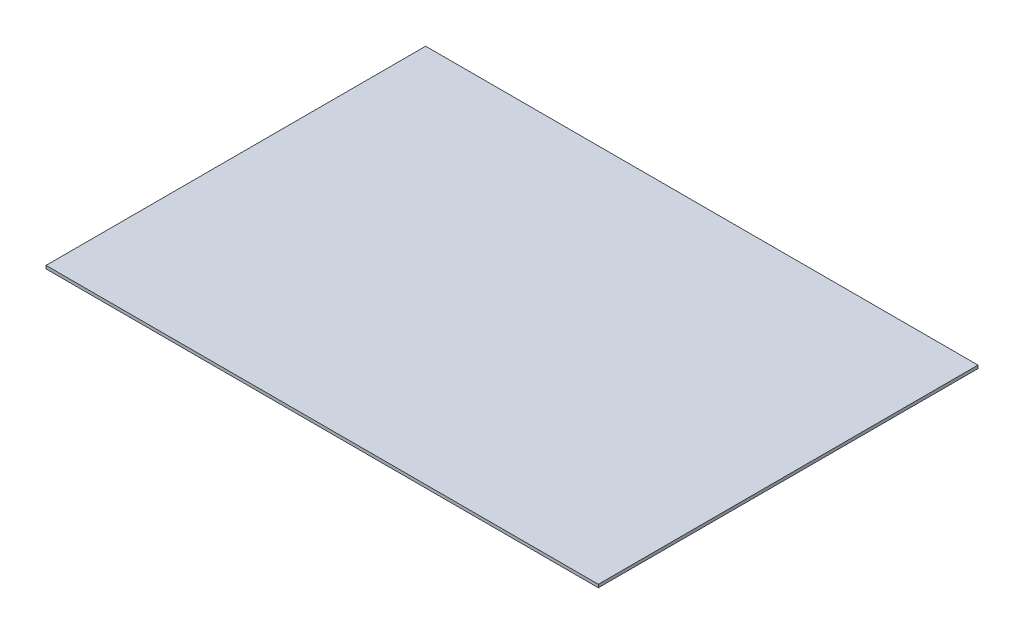
ISO-10303-21;
HEADER;
FILE_DESCRIPTION(('STEP AP214'),'2;1');
FILE_NAME('part.step','',(''),(''),'','','');
FILE_SCHEMA(('AUTOMOTIVE_DESIGN { 1 0 10303 214 1 1 1 1 }'));
ENDSEC;
DATA;
#1=APPLICATION_CONTEXT('core data for automotive mechanical design processes');
#2=APPLICATION_PROTOCOL_DEFINITION('international standard','automotive_design',2000,#1);
#3=PRODUCT_CONTEXT('',#1,'mechanical');
#4=PRODUCT('Part','Part','',(#3));
#5=PRODUCT_RELATED_PRODUCT_CATEGORY('part','',(#4));
#6=PRODUCT_DEFINITION_FORMATION('','',#4);
#7=PRODUCT_DEFINITION_CONTEXT('part definition',#1,'design');
#8=PRODUCT_DEFINITION('design','',#6,#7);
#9=PRODUCT_DEFINITION_SHAPE('','',#8);
#10=(LENGTH_UNIT() NAMED_UNIT(*) SI_UNIT(.MILLI.,.METRE.));
#11=(NAMED_UNIT(*) PLANE_ANGLE_UNIT() SI_UNIT($,.RADIAN.));
#12=(NAMED_UNIT(*) SI_UNIT($,.STERADIAN.) SOLID_ANGLE_UNIT());
#13=UNCERTAINTY_MEASURE_WITH_UNIT(LENGTH_MEASURE(1.E-05),#10,'distance_accuracy_value','');
#14=(GEOMETRIC_REPRESENTATION_CONTEXT(3) GLOBAL_UNCERTAINTY_ASSIGNED_CONTEXT((#13)) GLOBAL_UNIT_ASSIGNED_CONTEXT((#10,
#11,#12)) REPRESENTATION_CONTEXT('',''));
#15=CARTESIAN_POINT('',(0.,0.,0.));
#16=DIRECTION('',(0.,0.,1.));
#17=DIRECTION('',(1.,0.,0.));
#18=AXIS2_PLACEMENT_3D('',#15,#16,#17);
#19=CARTESIAN_POINT('',(0.,2.,0.));
#20=DIRECTION('',(0.,0.,-1.));
#21=DIRECTION('',(-1.,0.,0.));
#22=AXIS2_PLACEMENT_3D('',#19,#20,#21);
#23=PLANE('',#22);
#24=DIRECTION('',(1.,0.,0.));
#25=VECTOR('',#24,1.);
#26=CARTESIAN_POINT('',(0.,0.,0.));
#27=LINE('',#26,#25);
#28=CARTESIAN_POINT('',(0.,0.,0.));
#29=VERTEX_POINT('',#28);
#30=CARTESIAN_POINT('',(362.14,0.,0.));
#31=VERTEX_POINT('',#30);
#32=EDGE_CURVE('E101',#29,#31,#27,.T.);
#33=ORIENTED_EDGE('',*,*,#32,.T.);
#34=DIRECTION('',(0.,-1.,0.));
#35=VECTOR('',#34,1.);
#36=CARTESIAN_POINT('',(362.14,2.,0.));
#37=LINE('',#36,#35);
#38=CARTESIAN_POINT('',(362.14,2.,0.));
#39=VERTEX_POINT('',#38);
#40=EDGE_CURVE('E11',#39,#31,#37,.T.);
#41=ORIENTED_EDGE('',*,*,#40,.F.);
#42=DIRECTION('',(1.,0.,0.));
#43=VECTOR('',#42,1.);
#44=CARTESIAN_POINT('',(0.,2.,0.));
#45=LINE('',#44,#43);
#46=CARTESIAN_POINT('',(0.,2.,0.));
#47=VERTEX_POINT('',#46);
#48=EDGE_CURVE('E87',#47,#39,#45,.T.);
#49=ORIENTED_EDGE('',*,*,#48,.F.);
#50=DIRECTION('',(0.,-1.,0.));
#51=VECTOR('',#50,1.);
#52=CARTESIAN_POINT('',(0.,2.,0.));
#53=LINE('',#52,#51);
#54=EDGE_CURVE('E54',#47,#29,#53,.T.);
#55=ORIENTED_EDGE('',*,*,#54,.T.);
#56=EDGE_LOOP('',(#33,#41,#49,#55));
#57=FACE_BOUND('',#56,.T.);
#58=ADVANCED_FACE('F38',(#57),#23,.F.);
#59=CARTESIAN_POINT('',(362.14,2.,0.));
#60=DIRECTION('',(-1.,0.,0.));
#61=DIRECTION('',(0.,0.,1.));
#62=AXIS2_PLACEMENT_3D('',#59,#60,#61);
#63=PLANE('',#62);
#64=DIRECTION('',(0.,0.,-1.));
#65=VECTOR('',#64,1.);
#66=CARTESIAN_POINT('',(362.14,0.,0.));
#67=LINE('',#66,#65);
#68=CARTESIAN_POINT('',(362.14,0.,-248.92));
#69=VERTEX_POINT('',#68);
#70=EDGE_CURVE('E92',#31,#69,#67,.T.);
#71=ORIENTED_EDGE('',*,*,#70,.T.);
#72=DIRECTION('',(0.,-1.,0.));
#73=VECTOR('',#72,1.);
#74=CARTESIAN_POINT('',(362.14,2.,-248.92));
#75=LINE('',#74,#73);
#76=CARTESIAN_POINT('',(362.14,2.,-248.92));
#77=VERTEX_POINT('',#76);
#78=EDGE_CURVE('E46',#77,#69,#75,.T.);
#79=ORIENTED_EDGE('',*,*,#78,.F.);
#80=DIRECTION('',(0.,0.,-1.));
#81=VECTOR('',#80,1.);
#82=CARTESIAN_POINT('',(362.14,2.,0.));
#83=LINE('',#82,#81);
#84=EDGE_CURVE('E79',#39,#77,#83,.T.);
#85=ORIENTED_EDGE('',*,*,#84,.F.);
#86=ORIENTED_EDGE('',*,*,#40,.T.);
#87=EDGE_LOOP('',(#71,#79,#85,#86));
#88=FACE_BOUND('',#87,.T.);
#89=ADVANCED_FACE('F91',(#88),#63,.F.);
#90=CARTESIAN_POINT('',(0.,2.,-248.92));
#91=DIRECTION('',(0.,0.,-1.));
#92=DIRECTION('',(-1.,0.,0.));
#93=AXIS2_PLACEMENT_3D('',#90,#91,#92);
#94=PLANE('',#93);
#95=DIRECTION('',(1.,0.,0.));
#96=VECTOR('',#95,1.);
#97=CARTESIAN_POINT('',(0.,0.,-248.92));
#98=LINE('',#97,#96);
#99=CARTESIAN_POINT('',(0.,0.,-248.92));
#100=VERTEX_POINT('',#99);
#101=EDGE_CURVE('E104',#100,#69,#98,.T.);
#102=ORIENTED_EDGE('',*,*,#101,.F.);
#103=DIRECTION('',(0.,-1.,0.));
#104=VECTOR('',#103,1.);
#105=CARTESIAN_POINT('',(0.,2.,-248.92));
#106=LINE('',#105,#104);
#107=CARTESIAN_POINT('',(0.,2.,-248.92));
#108=VERTEX_POINT('',#107);
#109=EDGE_CURVE('E68',#108,#100,#106,.T.);
#110=ORIENTED_EDGE('',*,*,#109,.F.);
#111=DIRECTION('',(1.,0.,0.));
#112=VECTOR('',#111,1.);
#113=CARTESIAN_POINT('',(0.,2.,-248.92));
#114=LINE('',#113,#112);
#115=EDGE_CURVE('E86',#108,#77,#114,.T.);
#116=ORIENTED_EDGE('',*,*,#115,.T.);
#117=ORIENTED_EDGE('',*,*,#78,.T.);
#118=EDGE_LOOP('',(#102,#110,#116,#117));
#119=FACE_BOUND('',#118,.T.);
#120=ADVANCED_FACE('F95',(#119),#94,.T.);
#121=CARTESIAN_POINT('',(0.,2.,0.));
#122=DIRECTION('',(-1.,0.,0.));
#123=DIRECTION('',(0.,0.,1.));
#124=AXIS2_PLACEMENT_3D('',#121,#122,#123);
#125=PLANE('',#124);
#126=DIRECTION('',(0.,0.,-1.));
#127=VECTOR('',#126,1.);
#128=CARTESIAN_POINT('',(0.,0.,0.));
#129=LINE('',#128,#127);
#130=EDGE_CURVE('E106',#29,#100,#129,.T.);
#131=ORIENTED_EDGE('',*,*,#130,.F.);
#132=ORIENTED_EDGE('',*,*,#54,.F.);
#133=DIRECTION('',(0.,0.,-1.));
#134=VECTOR('',#133,1.);
#135=CARTESIAN_POINT('',(0.,2.,0.));
#136=LINE('',#135,#134);
#137=EDGE_CURVE('E96',#47,#108,#136,.T.);
#138=ORIENTED_EDGE('',*,*,#137,.T.);
#139=ORIENTED_EDGE('',*,*,#109,.T.);
#140=EDGE_LOOP('',(#131,#132,#138,#139));
#141=FACE_BOUND('',#140,.T.);
#142=ADVANCED_FACE('F112',(#141),#125,.T.);
#143=CARTESIAN_POINT('',(0.,2.,0.));
#144=DIRECTION('',(0.,1.,0.));
#145=DIRECTION('',(0.,0.,1.));
#146=AXIS2_PLACEMENT_3D('',#143,#144,#145);
#147=PLANE('',#146);
#148=ORIENTED_EDGE('',*,*,#48,.T.);
#149=ORIENTED_EDGE('',*,*,#84,.T.);
#150=ORIENTED_EDGE('',*,*,#115,.F.);
#151=ORIENTED_EDGE('',*,*,#137,.F.);
#152=EDGE_LOOP('',(#148,#149,#150,#151));
#153=FACE_BOUND('',#152,.T.);
#154=ADVANCED_FACE('F83',(#153),#147,.T.);
#155=CARTESIAN_POINT('',(0.,0.,0.));
#156=DIRECTION('',(0.,1.,0.));
#157=DIRECTION('',(0.,0.,1.));
#158=AXIS2_PLACEMENT_3D('',#155,#156,#157);
#159=PLANE('',#158);
#160=ORIENTED_EDGE('',*,*,#32,.F.);
#161=ORIENTED_EDGE('',*,*,#130,.T.);
#162=ORIENTED_EDGE('',*,*,#101,.T.);
#163=ORIENTED_EDGE('',*,*,#70,.F.);
#164=EDGE_LOOP('',(#160,#161,#162,#163));
#165=FACE_BOUND('',#164,.T.);
#166=ADVANCED_FACE('F111',(#165),#159,.F.);
#167=CLOSED_SHELL('',(#58,#89,#120,#142,#154,#166));
#168=MANIFOLD_SOLID_BREP('B2',#167);
#169=ADVANCED_BREP_SHAPE_REPRESENTATION('',(#18,#168),#14);
#170=SHAPE_DEFINITION_REPRESENTATION(#9,#169);
ENDSEC;
END-ISO-10303-21;
